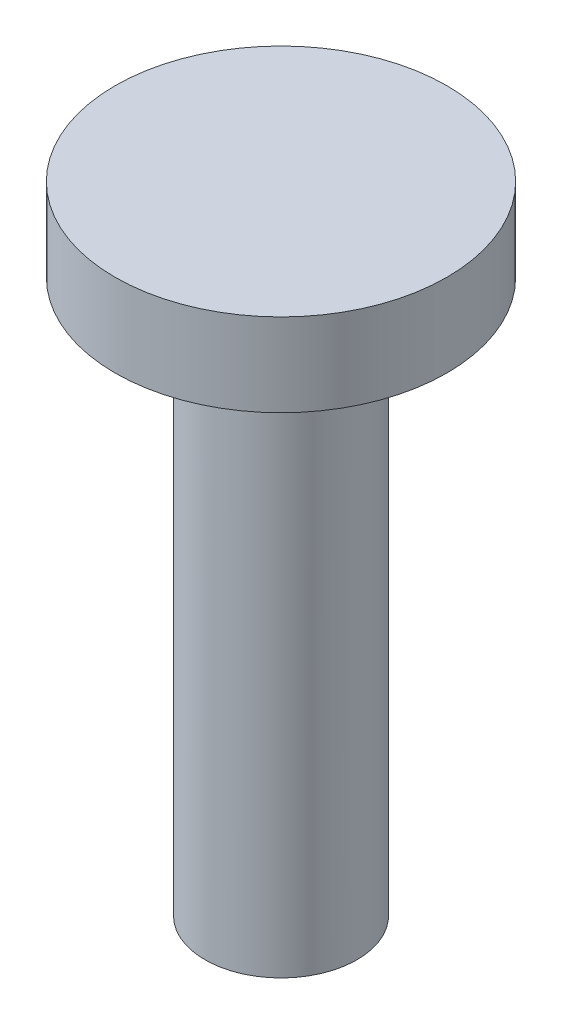
ISO-10303-21;
HEADER;
FILE_DESCRIPTION(('STEP AP214'),'2;1');
FILE_NAME('part.step','',(''),(''),'','','');
FILE_SCHEMA(('AUTOMOTIVE_DESIGN { 1 0 10303 214 1 1 1 1 }'));
ENDSEC;
DATA;
#1=APPLICATION_CONTEXT('core data for automotive mechanical design processes');
#2=APPLICATION_PROTOCOL_DEFINITION('international standard','automotive_design',2000,#1);
#3=PRODUCT_CONTEXT('',#1,'mechanical');
#4=PRODUCT('Part','Part','',(#3));
#5=PRODUCT_RELATED_PRODUCT_CATEGORY('part','',(#4));
#6=PRODUCT_DEFINITION_FORMATION('','',#4);
#7=PRODUCT_DEFINITION_CONTEXT('part definition',#1,'design');
#8=PRODUCT_DEFINITION('design','',#6,#7);
#9=PRODUCT_DEFINITION_SHAPE('','',#8);
#10=(LENGTH_UNIT() NAMED_UNIT(*) SI_UNIT(.MILLI.,.METRE.));
#11=(NAMED_UNIT(*) PLANE_ANGLE_UNIT() SI_UNIT($,.RADIAN.));
#12=(NAMED_UNIT(*) SI_UNIT($,.STERADIAN.) SOLID_ANGLE_UNIT());
#13=UNCERTAINTY_MEASURE_WITH_UNIT(LENGTH_MEASURE(1.E-05),#10,'distance_accuracy_value','');
#14=(GEOMETRIC_REPRESENTATION_CONTEXT(3) GLOBAL_UNCERTAINTY_ASSIGNED_CONTEXT((#13)) GLOBAL_UNIT_ASSIGNED_CONTEXT((#10,
#11,#12)) REPRESENTATION_CONTEXT('',''));
#15=CARTESIAN_POINT('',(0.,0.,0.));
#16=DIRECTION('',(0.,0.,1.));
#17=DIRECTION('',(1.,0.,0.));
#18=AXIS2_PLACEMENT_3D('',#15,#16,#17);
#19=CARTESIAN_POINT('',(0.,46.3333333333333,0.));
#20=DIRECTION('',(0.,-1.,0.));
#21=DIRECTION('',(0.,0.,-1.));
#22=AXIS2_PLACEMENT_3D('',#19,#20,#21);
#23=CYLINDRICAL_SURFACE('',#22,6.);
#24=CARTESIAN_POINT('',(0.,46.3333333333333,0.));
#25=DIRECTION('',(0.,1.,0.));
#26=DIRECTION('',(0.,0.,1.));
#27=AXIS2_PLACEMENT_3D('',#24,#25,#26);
#28=CIRCLE('',#27,6.);
#29=CARTESIAN_POINT('',(0.,46.3333333333333,6.));
#30=VERTEX_POINT('',#29);
#31=EDGE_CURVE('E10',#30,#30,#28,.T.);
#32=ORIENTED_EDGE('',*,*,#31,.F.);
#33=EDGE_LOOP('',(#32));
#34=FACE_BOUND('',#33,.T.);
#35=CARTESIAN_POINT('',(0.,43.3333333333333,0.));
#36=DIRECTION('',(0.,1.,0.));
#37=DIRECTION('',(0.,0.,1.));
#38=AXIS2_PLACEMENT_3D('',#35,#36,#37);
#39=CIRCLE('',#38,6.);
#40=CARTESIAN_POINT('',(0.,43.3333333333333,6.));
#41=VERTEX_POINT('',#40);
#42=EDGE_CURVE('E37',#41,#41,#39,.T.);
#43=ORIENTED_EDGE('',*,*,#42,.T.);
#44=EDGE_LOOP('',(#43));
#45=FACE_BOUND('',#44,.T.);
#46=ADVANCED_FACE('F33',(#34,#45),#23,.T.);
#47=CARTESIAN_POINT('',(0.,46.3333333333333,0.));
#48=DIRECTION('',(0.,1.,0.));
#49=DIRECTION('',(0.,0.,1.));
#50=AXIS2_PLACEMENT_3D('',#47,#48,#49);
#51=PLANE('',#50);
#52=ORIENTED_EDGE('',*,*,#31,.T.);
#53=EDGE_LOOP('',(#52));
#54=FACE_BOUND('',#53,.T.);
#55=ADVANCED_FACE('F61',(#54),#51,.T.);
#56=CARTESIAN_POINT('',(0.,43.3333333333333,0.));
#57=DIRECTION('',(0.,1.,0.));
#58=DIRECTION('',(0.,0.,1.));
#59=AXIS2_PLACEMENT_3D('',#56,#57,#58);
#60=PLANE('',#59);
#61=ORIENTED_EDGE('',*,*,#42,.F.);
#62=EDGE_LOOP('',(#61));
#63=FACE_BOUND('',#62,.T.);
#64=CARTESIAN_POINT('',(0.,43.3333333333333,0.));
#65=DIRECTION('',(0.,1.,0.));
#66=DIRECTION('',(0.,0.,1.));
#67=AXIS2_PLACEMENT_3D('',#64,#65,#66);
#68=CIRCLE('',#67,2.75);
#69=CARTESIAN_POINT('',(0.,43.3333333333333,2.75));
#70=VERTEX_POINT('',#69);
#71=EDGE_CURVE('E44',#70,#70,#68,.F.);
#72=ORIENTED_EDGE('',*,*,#71,.F.);
#73=EDGE_LOOP('',(#72));
#74=FACE_BOUND('',#73,.T.);
#75=ADVANCED_FACE('F56',(#63,#74),#60,.F.);
#76=CARTESIAN_POINT('',(0.,51.8186147075719,0.));
#77=DIRECTION('',(0.,-1.,0.));
#78=DIRECTION('',(0.,0.,-1.));
#79=AXIS2_PLACEMENT_3D('',#76,#77,#78);
#80=CYLINDRICAL_SURFACE('',#79,2.75);
#81=CARTESIAN_POINT('',(0.,23.3333333333333,0.));
#82=DIRECTION('',(0.,-1.,0.));
#83=DIRECTION('',(0.,0.,-1.));
#84=AXIS2_PLACEMENT_3D('',#81,#82,#83);
#85=CIRCLE('',#84,2.75);
#86=CARTESIAN_POINT('',(0.,23.3333333333333,-2.75));
#87=VERTEX_POINT('',#86);
#88=EDGE_CURVE('E48',#87,#87,#85,.T.);
#89=ORIENTED_EDGE('',*,*,#88,.F.);
#90=EDGE_LOOP('',(#89));
#91=FACE_BOUND('',#90,.T.);
#92=ORIENTED_EDGE('',*,*,#71,.T.);
#93=EDGE_LOOP('',(#92));
#94=FACE_BOUND('',#93,.T.);
#95=ADVANCED_FACE('F53',(#91,#94),#80,.T.);
#96=CARTESIAN_POINT('',(0.,23.3333333333333,0.));
#97=DIRECTION('',(0.,1.,0.));
#98=DIRECTION('',(0.,0.,1.));
#99=AXIS2_PLACEMENT_3D('',#96,#97,#98);
#100=PLANE('',#99);
#101=ORIENTED_EDGE('',*,*,#88,.T.);
#102=EDGE_LOOP('',(#101));
#103=FACE_BOUND('',#102,.T.);
#104=ADVANCED_FACE('F35',(#103),#100,.F.);
#105=CLOSED_SHELL('',(#46,#55,#75,#95,#104));
#106=MANIFOLD_SOLID_BREP('B2',#105);
#107=ADVANCED_BREP_SHAPE_REPRESENTATION('',(#18,#106),#14);
#108=SHAPE_DEFINITION_REPRESENTATION(#9,#107);
ENDSEC;
END-ISO-10303-21;
